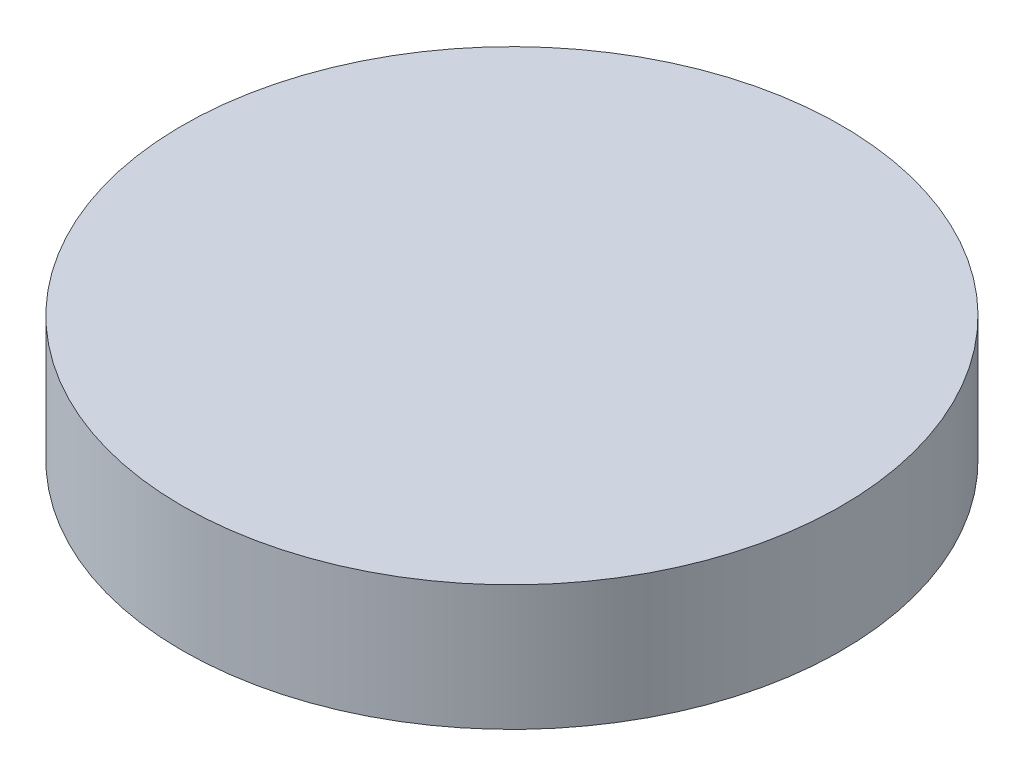
ISO-10303-21;
HEADER;
FILE_DESCRIPTION(('STEP AP214'),'2;1');
FILE_NAME('part.step','',(''),(''),'','','');
FILE_SCHEMA(('AUTOMOTIVE_DESIGN { 1 0 10303 214 1 1 1 1 }'));
ENDSEC;
DATA;
#1=APPLICATION_CONTEXT('core data for automotive mechanical design processes');
#2=APPLICATION_PROTOCOL_DEFINITION('international standard','automotive_design',2000,#1);
#3=PRODUCT_CONTEXT('',#1,'mechanical');
#4=PRODUCT('Part','Part','',(#3));
#5=PRODUCT_RELATED_PRODUCT_CATEGORY('part','',(#4));
#6=PRODUCT_DEFINITION_FORMATION('','',#4);
#7=PRODUCT_DEFINITION_CONTEXT('part definition',#1,'design');
#8=PRODUCT_DEFINITION('design','',#6,#7);
#9=PRODUCT_DEFINITION_SHAPE('','',#8);
#10=(LENGTH_UNIT() NAMED_UNIT(*) SI_UNIT(.MILLI.,.METRE.));
#11=(NAMED_UNIT(*) PLANE_ANGLE_UNIT() SI_UNIT($,.RADIAN.));
#12=(NAMED_UNIT(*) SI_UNIT($,.STERADIAN.) SOLID_ANGLE_UNIT());
#13=UNCERTAINTY_MEASURE_WITH_UNIT(LENGTH_MEASURE(1.E-05),#10,'distance_accuracy_value','');
#14=(GEOMETRIC_REPRESENTATION_CONTEXT(3) GLOBAL_UNCERTAINTY_ASSIGNED_CONTEXT((#13)) GLOBAL_UNIT_ASSIGNED_CONTEXT((#10,
#11,#12)) REPRESENTATION_CONTEXT('',''));
#15=CARTESIAN_POINT('',(0.,0.,0.));
#16=DIRECTION('',(0.,0.,1.));
#17=DIRECTION('',(1.,0.,0.));
#18=AXIS2_PLACEMENT_3D('',#15,#16,#17);
#19=CARTESIAN_POINT('',(0.,57.,0.));
#20=DIRECTION('',(0.,-1.,0.));
#21=DIRECTION('',(0.,0.,-1.));
#22=AXIS2_PLACEMENT_3D('',#19,#20,#21);
#23=CYLINDRICAL_SURFACE('',#22,150.);
#24=CARTESIAN_POINT('',(0.,57.,0.));
#25=DIRECTION('',(0.,1.,0.));
#26=DIRECTION('',(0.,0.,1.));
#27=AXIS2_PLACEMENT_3D('',#24,#25,#26);
#28=CIRCLE('',#27,150.);
#29=CARTESIAN_POINT('',(0.,57.,150.));
#30=VERTEX_POINT('',#29);
#31=EDGE_CURVE('E10',#30,#30,#28,.T.);
#32=ORIENTED_EDGE('',*,*,#31,.F.);
#33=EDGE_LOOP('',(#32));
#34=FACE_BOUND('',#33,.T.);
#35=CARTESIAN_POINT('',(0.,0.,0.));
#36=DIRECTION('',(0.,1.,0.));
#37=DIRECTION('',(0.,0.,1.));
#38=AXIS2_PLACEMENT_3D('',#35,#36,#37);
#39=CIRCLE('',#38,150.);
#40=CARTESIAN_POINT('',(0.,0.,150.));
#41=VERTEX_POINT('',#40);
#42=EDGE_CURVE('E36',#41,#41,#39,.T.);
#43=ORIENTED_EDGE('',*,*,#42,.T.);
#44=EDGE_LOOP('',(#43));
#45=FACE_BOUND('',#44,.T.);
#46=ADVANCED_FACE('F30',(#34,#45),#23,.T.);
#47=CARTESIAN_POINT('',(0.,57.,0.));
#48=DIRECTION('',(0.,1.,0.));
#49=DIRECTION('',(0.,0.,1.));
#50=AXIS2_PLACEMENT_3D('',#47,#48,#49);
#51=PLANE('',#50);
#52=ORIENTED_EDGE('',*,*,#31,.T.);
#53=EDGE_LOOP('',(#52));
#54=FACE_BOUND('',#53,.T.);
#55=ADVANCED_FACE('F45',(#54),#51,.T.);
#56=CARTESIAN_POINT('',(0.,0.,0.));
#57=DIRECTION('',(0.,1.,0.));
#58=DIRECTION('',(0.,0.,1.));
#59=AXIS2_PLACEMENT_3D('',#56,#57,#58);
#60=PLANE('',#59);
#61=ORIENTED_EDGE('',*,*,#42,.F.);
#62=EDGE_LOOP('',(#61));
#63=FACE_BOUND('',#62,.T.);
#64=ADVANCED_FACE('F43',(#63),#60,.F.);
#65=CLOSED_SHELL('',(#46,#55,#64));
#66=MANIFOLD_SOLID_BREP('B2',#65);
#67=ADVANCED_BREP_SHAPE_REPRESENTATION('',(#18,#66),#14);
#68=SHAPE_DEFINITION_REPRESENTATION(#9,#67);
ENDSEC;
END-ISO-10303-21;
